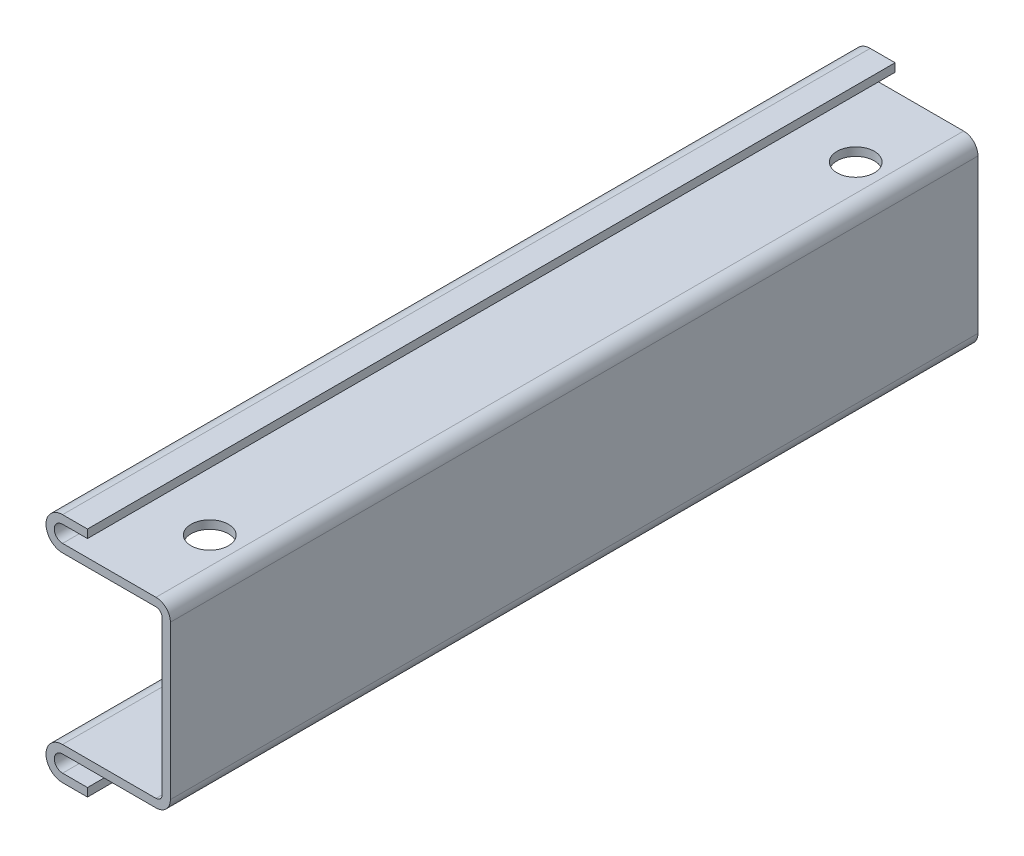
ISO-10303-21;
HEADER;
FILE_DESCRIPTION(('STEP AP214'),'2;1');
FILE_NAME('part.step','',(''),(''),'','','');
FILE_SCHEMA(('AUTOMOTIVE_DESIGN { 1 0 10303 214 1 1 1 1 }'));
ENDSEC;
DATA;
#1=APPLICATION_CONTEXT('core data for automotive mechanical design processes');
#2=APPLICATION_PROTOCOL_DEFINITION('international standard','automotive_design',2000,#1);
#3=PRODUCT_CONTEXT('',#1,'mechanical');
#4=PRODUCT('Part','Part','',(#3));
#5=PRODUCT_RELATED_PRODUCT_CATEGORY('part','',(#4));
#6=PRODUCT_DEFINITION_FORMATION('','',#4);
#7=PRODUCT_DEFINITION_CONTEXT('part definition',#1,'design');
#8=PRODUCT_DEFINITION('design','',#6,#7);
#9=PRODUCT_DEFINITION_SHAPE('','',#8);
#10=(LENGTH_UNIT() NAMED_UNIT(*) SI_UNIT(.MILLI.,.METRE.));
#11=(NAMED_UNIT(*) PLANE_ANGLE_UNIT() SI_UNIT($,.RADIAN.));
#12=(NAMED_UNIT(*) SI_UNIT($,.STERADIAN.) SOLID_ANGLE_UNIT());
#13=UNCERTAINTY_MEASURE_WITH_UNIT(LENGTH_MEASURE(1.E-05),#10,'distance_accuracy_value','');
#14=(GEOMETRIC_REPRESENTATION_CONTEXT(3) GLOBAL_UNCERTAINTY_ASSIGNED_CONTEXT((#13)) GLOBAL_UNIT_ASSIGNED_CONTEXT((#10,
#11,#12)) REPRESENTATION_CONTEXT('',''));
#15=CARTESIAN_POINT('',(0.,0.,0.));
#16=DIRECTION('',(0.,0.,1.));
#17=DIRECTION('',(1.,0.,0.));
#18=AXIS2_PLACEMENT_3D('',#15,#16,#17);
#19=CARTESIAN_POINT('',(-1.7365999999992,0.,97.4));
#20=DIRECTION('',(0.,0.,-1.));
#21=DIRECTION('',(-1.,0.,0.));
#22=AXIS2_PLACEMENT_3D('',#19,#20,#21);
#23=CYLINDRICAL_SURFACE('',#22,0.736599999999754);
#24=CARTESIAN_POINT('',(-1.7365999999992,0.,0.));
#25=DIRECTION('',(0.,0.,-1.));
#26=DIRECTION('',(1.,0.,0.));
#27=AXIS2_PLACEMENT_3D('',#24,#25,#26);
#28=CIRCLE('',#27,0.736599999999754);
#29=CARTESIAN_POINT('',(-1.7365999999992,0.736599999999754,0.));
#30=VERTEX_POINT('',#29);
#31=CARTESIAN_POINT('',(-0.999999999999446,0.,0.));
#32=VERTEX_POINT('',#31);
#33=EDGE_CURVE('E205',#30,#32,#28,.T.);
#34=ORIENTED_EDGE('',*,*,#33,.T.);
#35=DIRECTION('',(0.,0.,-1.));
#36=VECTOR('',#35,1.);
#37=CARTESIAN_POINT('',(-0.999999999999446,0.,97.4));
#38=LINE('',#37,#36);
#39=CARTESIAN_POINT('',(-0.999999999999446,0.,97.4));
#40=VERTEX_POINT('',#39);
#41=EDGE_CURVE('E11',#40,#32,#38,.T.);
#42=ORIENTED_EDGE('',*,*,#41,.F.);
#43=CARTESIAN_POINT('',(-1.7365999999992,0.,97.4));
#44=DIRECTION('',(0.,0.,-1.));
#45=DIRECTION('',(1.,0.,0.));
#46=AXIS2_PLACEMENT_3D('',#43,#44,#45);
#47=CIRCLE('',#46,0.736599999999754);
#48=CARTESIAN_POINT('',(-1.7365999999992,0.736599999999754,97.4));
#49=VERTEX_POINT('',#48);
#50=EDGE_CURVE('E244',#49,#40,#47,.T.);
#51=ORIENTED_EDGE('',*,*,#50,.F.);
#52=DIRECTION('',(0.,0.,-1.));
#53=VECTOR('',#52,1.);
#54=CARTESIAN_POINT('',(-1.7365999999992,0.736599999999754,97.4));
#55=LINE('',#54,#53);
#56=EDGE_CURVE('E201',#49,#30,#55,.T.);
#57=ORIENTED_EDGE('',*,*,#56,.T.);
#58=EDGE_LOOP('',(#34,#42,#51,#57));
#59=FACE_BOUND('',#58,.T.);
#60=ADVANCED_FACE('F35',(#59),#23,.F.);
#61=CARTESIAN_POINT('',(-0.999999999999446,0.,97.4));
#62=DIRECTION('',(1.,0.,0.));
#63=DIRECTION('',(0.,0.,-1.));
#64=AXIS2_PLACEMENT_3D('',#61,#62,#63);
#65=PLANE('',#64);
#66=DIRECTION('',(0.,-1.,0.));
#67=VECTOR('',#66,1.);
#68=CARTESIAN_POINT('',(-0.999999999999446,0.,0.));
#69=LINE('',#68,#67);
#70=CARTESIAN_POINT('',(-0.999999999999446,-18.5268000000001,0.));
#71=VERTEX_POINT('',#70);
#72=EDGE_CURVE('E208',#32,#71,#69,.T.);
#73=ORIENTED_EDGE('',*,*,#72,.T.);
#74=DIRECTION('',(0.,0.,-1.));
#75=VECTOR('',#74,1.);
#76=CARTESIAN_POINT('',(-0.999999999999446,-18.5268000000001,97.4));
#77=LINE('',#76,#75);
#78=CARTESIAN_POINT('',(-0.999999999999446,-18.5268000000001,97.4));
#79=VERTEX_POINT('',#78);
#80=EDGE_CURVE('E44',#79,#71,#77,.T.);
#81=ORIENTED_EDGE('',*,*,#80,.F.);
#82=DIRECTION('',(0.,-1.,0.));
#83=VECTOR('',#82,1.);
#84=CARTESIAN_POINT('',(-0.999999999999446,0.,97.4));
#85=LINE('',#84,#83);
#86=EDGE_CURVE('E132',#40,#79,#85,.T.);
#87=ORIENTED_EDGE('',*,*,#86,.F.);
#88=ORIENTED_EDGE('',*,*,#41,.T.);
#89=EDGE_LOOP('',(#73,#81,#87,#88));
#90=FACE_BOUND('',#89,.T.);
#91=ADVANCED_FACE('F372',(#90),#65,.F.);
#92=CARTESIAN_POINT('',(-1.7365999999992,-18.5268000000001,97.4));
#93=DIRECTION('',(0.,0.,-1.));
#94=DIRECTION('',(-1.,0.,0.));
#95=AXIS2_PLACEMENT_3D('',#92,#93,#94);
#96=CYLINDRICAL_SURFACE('',#95,0.736599999999754);
#97=CARTESIAN_POINT('',(-1.7365999999992,-18.5268000000001,0.));
#98=DIRECTION('',(0.,0.,-1.));
#99=DIRECTION('',(1.,0.,0.));
#100=AXIS2_PLACEMENT_3D('',#97,#98,#99);
#101=CIRCLE('',#100,0.736599999999754);
#102=CARTESIAN_POINT('',(-1.7365999999992,-19.2633999999998,0.));
#103=VERTEX_POINT('',#102);
#104=EDGE_CURVE('E211',#71,#103,#101,.T.);
#105=ORIENTED_EDGE('',*,*,#104,.T.);
#106=DIRECTION('',(0.,0.,-1.));
#107=VECTOR('',#106,1.);
#108=CARTESIAN_POINT('',(-1.7365999999992,-19.2633999999998,97.4));
#109=LINE('',#108,#107);
#110=CARTESIAN_POINT('',(-1.7365999999992,-19.2633999999998,97.4));
#111=VERTEX_POINT('',#110);
#112=EDGE_CURVE('E287',#111,#103,#109,.T.);
#113=ORIENTED_EDGE('',*,*,#112,.F.);
#114=CARTESIAN_POINT('',(-1.7365999999992,-18.5268000000001,97.4));
#115=DIRECTION('',(0.,0.,-1.));
#116=DIRECTION('',(1.,0.,0.));
#117=AXIS2_PLACEMENT_3D('',#114,#115,#116);
#118=CIRCLE('',#117,0.736599999999754);
#119=EDGE_CURVE('E313',#79,#111,#118,.T.);
#120=ORIENTED_EDGE('',*,*,#119,.F.);
#121=ORIENTED_EDGE('',*,*,#80,.T.);
#122=EDGE_LOOP('',(#105,#113,#120,#121));
#123=FACE_BOUND('',#122,.T.);
#124=ADVANCED_FACE('F376',(#123),#96,.F.);
#125=CARTESIAN_POINT('',(-1.7365999999992,-19.2633999999998,97.4));
#126=DIRECTION('',(0.,-1.,0.));
#127=DIRECTION('',(0.,0.,-1.));
#128=AXIS2_PLACEMENT_3D('',#125,#126,#127);
#129=PLANE('',#128);
#130=CARTESIAN_POINT('',(-4.99999999999999,-19.2633999999998,9.74999999999999));
#131=DIRECTION('',(0.,-1.,0.));
#132=DIRECTION('',(0.,0.,-1.));
#133=AXIS2_PLACEMENT_3D('',#130,#131,#132);
#134=CIRCLE('',#133,2.25);
#135=CARTESIAN_POINT('',(-4.99999999999999,-19.2633999999998,7.49999999999999));
#136=VERTEX_POINT('',#135);
#137=EDGE_CURVE('E300',#136,#136,#134,.T.);
#138=ORIENTED_EDGE('',*,*,#137,.T.);
#139=EDGE_LOOP('',(#138));
#140=FACE_BOUND('',#139,.T.);
#141=CARTESIAN_POINT('',(-5.,-19.2633999999998,87.65));
#142=DIRECTION('',(0.,-1.,0.));
#143=DIRECTION('',(0.,0.,-1.));
#144=AXIS2_PLACEMENT_3D('',#141,#142,#143);
#145=CIRCLE('',#144,2.25);
#146=CARTESIAN_POINT('',(-5.,-19.2633999999998,85.4));
#147=VERTEX_POINT('',#146);
#148=EDGE_CURVE('E209',#147,#147,#145,.T.);
#149=ORIENTED_EDGE('',*,*,#148,.T.);
#150=EDGE_LOOP('',(#149));
#151=FACE_BOUND('',#150,.T.);
#152=DIRECTION('',(-1.,0.,0.));
#153=VECTOR('',#152,1.);
#154=CARTESIAN_POINT('',(-1.7365999999992,-19.2633999999998,0.));
#155=LINE('',#154,#153);
#156=CARTESIAN_POINT('',(-12.9999999999999,-19.2633999999998,0.));
#157=VERTEX_POINT('',#156);
#158=EDGE_CURVE('E213',#103,#157,#155,.T.);
#159=ORIENTED_EDGE('',*,*,#158,.T.);
#160=DIRECTION('',(0.,0.,-1.));
#161=VECTOR('',#160,1.);
#162=CARTESIAN_POINT('',(-12.9999999999999,-19.2633999999998,97.4));
#163=LINE('',#162,#161);
#164=CARTESIAN_POINT('',(-12.9999999999999,-19.2633999999998,97.4));
#165=VERTEX_POINT('',#164);
#166=EDGE_CURVE('E284',#165,#157,#163,.T.);
#167=ORIENTED_EDGE('',*,*,#166,.F.);
#168=DIRECTION('',(-1.,0.,0.));
#169=VECTOR('',#168,1.);
#170=CARTESIAN_POINT('',(-1.7365999999992,-19.2633999999998,97.4));
#171=LINE('',#170,#169);
#172=EDGE_CURVE('E315',#111,#165,#171,.T.);
#173=ORIENTED_EDGE('',*,*,#172,.F.);
#174=ORIENTED_EDGE('',*,*,#112,.T.);
#175=EDGE_LOOP('',(#159,#167,#173,#174));
#176=FACE_BOUND('',#175,.T.);
#177=ADVANCED_FACE('F380',(#140,#151,#176),#129,.F.);
#178=CARTESIAN_POINT('',(-12.9999999999999,-21.2633999999996,97.4));
#179=DIRECTION('',(0.,0.,-1.));
#180=DIRECTION('',(-1.,0.,0.));
#181=AXIS2_PLACEMENT_3D('',#178,#179,#180);
#182=CYLINDRICAL_SURFACE('',#181,1.99999999999978);
#183=CARTESIAN_POINT('',(-12.9999999999999,-21.2633999999996,0.));
#184=DIRECTION('',(0.,0.,1.));
#185=DIRECTION('',(1.,0.,0.));
#186=AXIS2_PLACEMENT_3D('',#183,#184,#185);
#187=CIRCLE('',#186,1.99999999999978);
#188=CARTESIAN_POINT('',(-12.9999999999999,-23.2633999999994,0.));
#189=VERTEX_POINT('',#188);
#190=EDGE_CURVE('E215',#157,#189,#187,.T.);
#191=ORIENTED_EDGE('',*,*,#190,.T.);
#192=DIRECTION('',(0.,0.,-1.));
#193=VECTOR('',#192,1.);
#194=CARTESIAN_POINT('',(-12.9999999999999,-23.2633999999994,97.4));
#195=LINE('',#194,#193);
#196=CARTESIAN_POINT('',(-12.9999999999999,-23.2633999999994,97.4));
#197=VERTEX_POINT('',#196);
#198=EDGE_CURVE('E281',#197,#189,#195,.T.);
#199=ORIENTED_EDGE('',*,*,#198,.F.);
#200=CARTESIAN_POINT('',(-12.9999999999999,-21.2633999999996,97.4));
#201=DIRECTION('',(0.,0.,1.));
#202=DIRECTION('',(1.,0.,0.));
#203=AXIS2_PLACEMENT_3D('',#200,#201,#202);
#204=CIRCLE('',#203,1.99999999999978);
#205=EDGE_CURVE('E317',#165,#197,#204,.T.);
#206=ORIENTED_EDGE('',*,*,#205,.F.);
#207=ORIENTED_EDGE('',*,*,#166,.T.);
#208=EDGE_LOOP('',(#191,#199,#206,#207));
#209=FACE_BOUND('',#208,.T.);
#210=ADVANCED_FACE('F386',(#209),#182,.T.);
#211=CARTESIAN_POINT('',(-12.9999999999999,-23.2633999999994,97.4));
#212=DIRECTION('',(0.,1.,0.));
#213=DIRECTION('',(0.,0.,1.));
#214=AXIS2_PLACEMENT_3D('',#211,#212,#213);
#215=PLANE('',#214);
#216=DIRECTION('',(1.,0.,0.));
#217=VECTOR('',#216,1.);
#218=CARTESIAN_POINT('',(-12.9999999999999,-23.2633999999994,0.));
#219=LINE('',#218,#217);
#220=CARTESIAN_POINT('',(-9.99999999999979,-23.2633999999994,0.));
#221=VERTEX_POINT('',#220);
#222=EDGE_CURVE('E217',#189,#221,#219,.T.);
#223=ORIENTED_EDGE('',*,*,#222,.T.);
#224=DIRECTION('',(0.,0.,-1.));
#225=VECTOR('',#224,1.);
#226=CARTESIAN_POINT('',(-9.99999999999979,-23.2633999999994,97.4));
#227=LINE('',#226,#225);
#228=CARTESIAN_POINT('',(-9.99999999999979,-23.2633999999994,97.4));
#229=VERTEX_POINT('',#228);
#230=EDGE_CURVE('E278',#229,#221,#227,.T.);
#231=ORIENTED_EDGE('',*,*,#230,.F.);
#232=DIRECTION('',(1.,0.,0.));
#233=VECTOR('',#232,1.);
#234=CARTESIAN_POINT('',(-12.9999999999999,-23.2633999999994,97.4));
#235=LINE('',#234,#233);
#236=EDGE_CURVE('E319',#197,#229,#235,.T.);
#237=ORIENTED_EDGE('',*,*,#236,.F.);
#238=ORIENTED_EDGE('',*,*,#198,.T.);
#239=EDGE_LOOP('',(#223,#231,#237,#238));
#240=FACE_BOUND('',#239,.T.);
#241=ADVANCED_FACE('F390',(#240),#215,.F.);
#242=CARTESIAN_POINT('',(-9.99999999999979,-22.2633999999999,97.4));
#243=DIRECTION('',(-1.,0.,0.));
#244=DIRECTION('',(0.,0.,1.));
#245=AXIS2_PLACEMENT_3D('',#242,#243,#244);
#246=PLANE('',#245);
#247=DIRECTION('',(0.,1.,0.));
#248=VECTOR('',#247,1.);
#249=CARTESIAN_POINT('',(-9.99999999999979,-22.2633999999999,0.));
#250=LINE('',#249,#248);
#251=CARTESIAN_POINT('',(-9.99999999999979,-22.2633999999999,0.));
#252=VERTEX_POINT('',#251);
#253=EDGE_CURVE('E219',#221,#252,#250,.T.);
#254=ORIENTED_EDGE('',*,*,#253,.T.);
#255=DIRECTION('',(0.,0.,-1.));
#256=VECTOR('',#255,1.);
#257=CARTESIAN_POINT('',(-9.99999999999979,-22.2633999999999,97.4));
#258=LINE('',#257,#256);
#259=CARTESIAN_POINT('',(-9.99999999999979,-22.2633999999999,97.4));
#260=VERTEX_POINT('',#259);
#261=EDGE_CURVE('E275',#260,#252,#258,.T.);
#262=ORIENTED_EDGE('',*,*,#261,.F.);
#263=DIRECTION('',(0.,1.,0.));
#264=VECTOR('',#263,1.);
#265=CARTESIAN_POINT('',(-9.99999999999979,-22.2633999999999,97.4));
#266=LINE('',#265,#264);
#267=EDGE_CURVE('E321',#229,#260,#266,.T.);
#268=ORIENTED_EDGE('',*,*,#267,.F.);
#269=ORIENTED_EDGE('',*,*,#230,.T.);
#270=EDGE_LOOP('',(#254,#262,#268,#269));
#271=FACE_BOUND('',#270,.T.);
#272=ADVANCED_FACE('F394',(#271),#246,.F.);
#273=CARTESIAN_POINT('',(-12.9999999999999,-22.2633999999999,97.4));
#274=DIRECTION('',(0.,-1.,0.));
#275=DIRECTION('',(0.,0.,-1.));
#276=AXIS2_PLACEMENT_3D('',#273,#274,#275);
#277=PLANE('',#276);
#278=DIRECTION('',(-1.,0.,0.));
#279=VECTOR('',#278,1.);
#280=CARTESIAN_POINT('',(-12.9999999999999,-22.2633999999999,0.));
#281=LINE('',#280,#279);
#282=CARTESIAN_POINT('',(-12.9999999999999,-22.2633999999999,0.));
#283=VERTEX_POINT('',#282);
#284=EDGE_CURVE('E221',#252,#283,#281,.T.);
#285=ORIENTED_EDGE('',*,*,#284,.T.);
#286=DIRECTION('',(0.,0.,-1.));
#287=VECTOR('',#286,1.);
#288=CARTESIAN_POINT('',(-12.9999999999999,-22.2633999999999,97.4));
#289=LINE('',#288,#287);
#290=CARTESIAN_POINT('',(-12.9999999999999,-22.2633999999999,97.4));
#291=VERTEX_POINT('',#290);
#292=EDGE_CURVE('E272',#291,#283,#289,.T.);
#293=ORIENTED_EDGE('',*,*,#292,.F.);
#294=DIRECTION('',(-1.,0.,0.));
#295=VECTOR('',#294,1.);
#296=CARTESIAN_POINT('',(-12.9999999999999,-22.2633999999999,97.4));
#297=LINE('',#296,#295);
#298=EDGE_CURVE('E323',#260,#291,#297,.T.);
#299=ORIENTED_EDGE('',*,*,#298,.F.);
#300=ORIENTED_EDGE('',*,*,#261,.T.);
#301=EDGE_LOOP('',(#285,#293,#299,#300));
#302=FACE_BOUND('',#301,.T.);
#303=ADVANCED_FACE('F398',(#302),#277,.F.);
#304=CARTESIAN_POINT('',(-12.9999999999999,-21.2633999999996,97.4));
#305=DIRECTION('',(0.,0.,-1.));
#306=DIRECTION('',(-1.,0.,0.));
#307=AXIS2_PLACEMENT_3D('',#304,#305,#306);
#308=CYLINDRICAL_SURFACE('',#307,1.00000000000033);
#309=CARTESIAN_POINT('',(-12.9999999999999,-21.2633999999996,0.));
#310=DIRECTION('',(0.,0.,-1.));
#311=DIRECTION('',(1.,0.,0.));
#312=AXIS2_PLACEMENT_3D('',#309,#310,#311);
#313=CIRCLE('',#312,1.00000000000033);
#314=CARTESIAN_POINT('',(-12.9999999999999,-20.2633999999993,0.));
#315=VERTEX_POINT('',#314);
#316=EDGE_CURVE('E223',#283,#315,#313,.T.);
#317=ORIENTED_EDGE('',*,*,#316,.T.);
#318=DIRECTION('',(0.,0.,-1.));
#319=VECTOR('',#318,1.);
#320=CARTESIAN_POINT('',(-12.9999999999999,-20.2633999999993,97.4));
#321=LINE('',#320,#319);
#322=CARTESIAN_POINT('',(-12.9999999999999,-20.2633999999993,97.4));
#323=VERTEX_POINT('',#322);
#324=EDGE_CURVE('E269',#323,#315,#321,.T.);
#325=ORIENTED_EDGE('',*,*,#324,.F.);
#326=CARTESIAN_POINT('',(-12.9999999999999,-21.2633999999996,97.4));
#327=DIRECTION('',(0.,0.,-1.));
#328=DIRECTION('',(1.,0.,0.));
#329=AXIS2_PLACEMENT_3D('',#326,#327,#328);
#330=CIRCLE('',#329,1.00000000000033);
#331=EDGE_CURVE('E325',#291,#323,#330,.T.);
#332=ORIENTED_EDGE('',*,*,#331,.F.);
#333=ORIENTED_EDGE('',*,*,#292,.T.);
#334=EDGE_LOOP('',(#317,#325,#332,#333));
#335=FACE_BOUND('',#334,.T.);
#336=ADVANCED_FACE('F402',(#335),#308,.F.);
#337=CARTESIAN_POINT('',(-1.7365999999992,-20.2633999999993,97.4));
#338=DIRECTION('',(0.,1.,0.));
#339=DIRECTION('',(0.,0.,1.));
#340=AXIS2_PLACEMENT_3D('',#337,#338,#339);
#341=PLANE('',#340);
#342=CARTESIAN_POINT('',(-4.99999999999999,-20.2633999999993,9.74999999999999));
#343=DIRECTION('',(0.,-1.,0.));
#344=DIRECTION('',(0.,0.,1.));
#345=AXIS2_PLACEMENT_3D('',#342,#343,#344);
#346=CIRCLE('',#345,2.25);
#347=CARTESIAN_POINT('',(-4.99999999999999,-20.2633999999993,12.));
#348=VERTEX_POINT('',#347);
#349=EDGE_CURVE('E501',#348,#348,#346,.T.);
#350=ORIENTED_EDGE('',*,*,#349,.F.);
#351=EDGE_LOOP('',(#350));
#352=FACE_BOUND('',#351,.T.);
#353=CARTESIAN_POINT('',(-5.,-20.2633999999993,87.65));
#354=DIRECTION('',(0.,-1.,0.));
#355=DIRECTION('',(0.,0.,-1.));
#356=AXIS2_PLACEMENT_3D('',#353,#354,#355);
#357=CIRCLE('',#356,2.25);
#358=CARTESIAN_POINT('',(-5.,-20.2633999999993,85.4));
#359=VERTEX_POINT('',#358);
#360=EDGE_CURVE('E294',#359,#359,#357,.T.);
#361=ORIENTED_EDGE('',*,*,#360,.F.);
#362=EDGE_LOOP('',(#361));
#363=FACE_BOUND('',#362,.T.);
#364=DIRECTION('',(1.,0.,0.));
#365=VECTOR('',#364,1.);
#366=CARTESIAN_POINT('',(-1.7365999999992,-20.2633999999993,0.));
#367=LINE('',#366,#365);
#368=CARTESIAN_POINT('',(-1.7365999999992,-20.2633999999993,0.));
#369=VERTEX_POINT('',#368);
#370=EDGE_CURVE('E225',#315,#369,#367,.T.);
#371=ORIENTED_EDGE('',*,*,#370,.T.);
#372=DIRECTION('',(0.,0.,-1.));
#373=VECTOR('',#372,1.);
#374=CARTESIAN_POINT('',(-1.7365999999992,-20.2633999999993,97.4));
#375=LINE('',#374,#373);
#376=CARTESIAN_POINT('',(-1.7365999999992,-20.2633999999993,97.4));
#377=VERTEX_POINT('',#376);
#378=EDGE_CURVE('E266',#377,#369,#375,.T.);
#379=ORIENTED_EDGE('',*,*,#378,.F.);
#380=DIRECTION('',(1.,0.,0.));
#381=VECTOR('',#380,1.);
#382=CARTESIAN_POINT('',(-1.7365999999992,-20.2633999999993,97.4));
#383=LINE('',#382,#381);
#384=EDGE_CURVE('E327',#323,#377,#383,.T.);
#385=ORIENTED_EDGE('',*,*,#384,.F.);
#386=ORIENTED_EDGE('',*,*,#324,.T.);
#387=EDGE_LOOP('',(#371,#379,#385,#386));
#388=FACE_BOUND('',#387,.T.);
#389=ADVANCED_FACE('F406',(#352,#363,#388),#341,.F.);
#390=CARTESIAN_POINT('',(-1.7365999999992,-18.5268000000001,97.4));
#391=DIRECTION('',(0.,0.,-1.));
#392=DIRECTION('',(-1.,0.,0.));
#393=AXIS2_PLACEMENT_3D('',#390,#391,#392);
#394=CYLINDRICAL_SURFACE('',#393,1.7365999999992);
#395=CARTESIAN_POINT('',(-1.7365999999992,-18.5268000000001,0.));
#396=DIRECTION('',(0.,0.,1.));
#397=DIRECTION('',(1.,0.,0.));
#398=AXIS2_PLACEMENT_3D('',#395,#396,#397);
#399=CIRCLE('',#398,1.7365999999992);
#400=CARTESIAN_POINT('',(0.,-18.5268000000001,0.));
#401=VERTEX_POINT('',#400);
#402=EDGE_CURVE('E227',#369,#401,#399,.T.);
#403=ORIENTED_EDGE('',*,*,#402,.T.);
#404=DIRECTION('',(0.,0.,-1.));
#405=VECTOR('',#404,1.);
#406=CARTESIAN_POINT('',(0.,-18.5268000000001,97.4));
#407=LINE('',#406,#405);
#408=CARTESIAN_POINT('',(0.,-18.5268000000001,97.4));
#409=VERTEX_POINT('',#408);
#410=EDGE_CURVE('E263',#409,#401,#407,.T.);
#411=ORIENTED_EDGE('',*,*,#410,.F.);
#412=CARTESIAN_POINT('',(-1.7365999999992,-18.5268000000001,97.4));
#413=DIRECTION('',(0.,0.,1.));
#414=DIRECTION('',(1.,0.,0.));
#415=AXIS2_PLACEMENT_3D('',#412,#413,#414);
#416=CIRCLE('',#415,1.7365999999992);
#417=EDGE_CURVE('E329',#377,#409,#416,.T.);
#418=ORIENTED_EDGE('',*,*,#417,.F.);
#419=ORIENTED_EDGE('',*,*,#378,.T.);
#420=EDGE_LOOP('',(#403,#411,#418,#419));
#421=FACE_BOUND('',#420,.T.);
#422=ADVANCED_FACE('F410',(#421),#394,.T.);
#423=CARTESIAN_POINT('',(0.,0.,97.4));
#424=DIRECTION('',(-1.,0.,0.));
#425=DIRECTION('',(0.,0.,1.));
#426=AXIS2_PLACEMENT_3D('',#423,#424,#425);
#427=PLANE('',#426);
#428=DIRECTION('',(0.,1.,0.));
#429=VECTOR('',#428,1.);
#430=CARTESIAN_POINT('',(0.,0.,0.));
#431=LINE('',#430,#429);
#432=CARTESIAN_POINT('',(0.,0.,0.));
#433=VERTEX_POINT('',#432);
#434=EDGE_CURVE('E229',#401,#433,#431,.T.);
#435=ORIENTED_EDGE('',*,*,#434,.T.);
#436=DIRECTION('',(0.,0.,-1.));
#437=VECTOR('',#436,1.);
#438=CARTESIAN_POINT('',(0.,0.,97.4));
#439=LINE('',#438,#437);
#440=CARTESIAN_POINT('',(0.,0.,97.4));
#441=VERTEX_POINT('',#440);
#442=EDGE_CURVE('E260',#441,#433,#439,.T.);
#443=ORIENTED_EDGE('',*,*,#442,.F.);
#444=DIRECTION('',(0.,1.,0.));
#445=VECTOR('',#444,1.);
#446=CARTESIAN_POINT('',(0.,0.,97.4));
#447=LINE('',#446,#445);
#448=EDGE_CURVE('E331',#409,#441,#447,.T.);
#449=ORIENTED_EDGE('',*,*,#448,.F.);
#450=ORIENTED_EDGE('',*,*,#410,.T.);
#451=EDGE_LOOP('',(#435,#443,#449,#450));
#452=FACE_BOUND('',#451,.T.);
#453=ADVANCED_FACE('F414',(#452),#427,.F.);
#454=CARTESIAN_POINT('',(-1.7365999999992,0.,97.4));
#455=DIRECTION('',(0.,0.,-1.));
#456=DIRECTION('',(-1.,0.,0.));
#457=AXIS2_PLACEMENT_3D('',#454,#455,#456);
#458=CYLINDRICAL_SURFACE('',#457,1.7365999999992);
#459=CARTESIAN_POINT('',(-1.7365999999992,0.,0.));
#460=DIRECTION('',(0.,0.,1.));
#461=DIRECTION('',(1.,0.,0.));
#462=AXIS2_PLACEMENT_3D('',#459,#460,#461);
#463=CIRCLE('',#462,1.7365999999992);
#464=CARTESIAN_POINT('',(-1.7365999999992,1.7365999999992,0.));
#465=VERTEX_POINT('',#464);
#466=EDGE_CURVE('E231',#433,#465,#463,.T.);
#467=ORIENTED_EDGE('',*,*,#466,.T.);
#468=DIRECTION('',(0.,0.,-1.));
#469=VECTOR('',#468,1.);
#470=CARTESIAN_POINT('',(-1.7365999999992,1.7365999999992,97.4));
#471=LINE('',#470,#469);
#472=CARTESIAN_POINT('',(-1.7365999999992,1.7365999999992,97.4));
#473=VERTEX_POINT('',#472);
#474=EDGE_CURVE('E257',#473,#465,#471,.T.);
#475=ORIENTED_EDGE('',*,*,#474,.F.);
#476=CARTESIAN_POINT('',(-1.7365999999992,0.,97.4));
#477=DIRECTION('',(0.,0.,1.));
#478=DIRECTION('',(1.,0.,0.));
#479=AXIS2_PLACEMENT_3D('',#476,#477,#478);
#480=CIRCLE('',#479,1.7365999999992);
#481=EDGE_CURVE('E333',#441,#473,#480,.T.);
#482=ORIENTED_EDGE('',*,*,#481,.F.);
#483=ORIENTED_EDGE('',*,*,#442,.T.);
#484=EDGE_LOOP('',(#467,#475,#482,#483));
#485=FACE_BOUND('',#484,.T.);
#486=ADVANCED_FACE('F418',(#485),#458,.T.);
#487=CARTESIAN_POINT('',(-12.9999999999999,1.7365999999992,97.4));
#488=DIRECTION('',(0.,-1.,0.));
#489=DIRECTION('',(0.,0.,-1.));
#490=AXIS2_PLACEMENT_3D('',#487,#488,#489);
#491=PLANE('',#490);
#492=CARTESIAN_POINT('',(-4.99999999999999,1.7365999999992,9.74999999999999));
#493=DIRECTION('',(0.,-1.,0.));
#494=DIRECTION('',(0.,0.,-1.));
#495=AXIS2_PLACEMENT_3D('',#492,#493,#494);
#496=CIRCLE('',#495,2.25);
#497=CARTESIAN_POINT('',(-4.99999999999999,1.7365999999992,7.49999999999999));
#498=VERTEX_POINT('',#497);
#499=EDGE_CURVE('E305',#498,#498,#496,.T.);
#500=ORIENTED_EDGE('',*,*,#499,.T.);
#501=EDGE_LOOP('',(#500));
#502=FACE_BOUND('',#501,.T.);
#503=CARTESIAN_POINT('',(-5.,1.7365999999992,87.65));
#504=DIRECTION('',(0.,-1.,0.));
#505=DIRECTION('',(0.,0.,-1.));
#506=AXIS2_PLACEMENT_3D('',#503,#504,#505);
#507=CIRCLE('',#506,2.25);
#508=CARTESIAN_POINT('',(-5.,1.7365999999992,85.4));
#509=VERTEX_POINT('',#508);
#510=EDGE_CURVE('E293',#509,#509,#507,.T.);
#511=ORIENTED_EDGE('',*,*,#510,.T.);
#512=EDGE_LOOP('',(#511));
#513=FACE_BOUND('',#512,.T.);
#514=DIRECTION('',(-1.,0.,0.));
#515=VECTOR('',#514,1.);
#516=CARTESIAN_POINT('',(-12.9999999999999,1.7365999999992,0.));
#517=LINE('',#516,#515);
#518=CARTESIAN_POINT('',(-12.9999999999999,1.7365999999992,0.));
#519=VERTEX_POINT('',#518);
#520=EDGE_CURVE('E233',#465,#519,#517,.T.);
#521=ORIENTED_EDGE('',*,*,#520,.T.);
#522=DIRECTION('',(0.,0.,-1.));
#523=VECTOR('',#522,1.);
#524=CARTESIAN_POINT('',(-12.9999999999999,1.7365999999992,97.4));
#525=LINE('',#524,#523);
#526=CARTESIAN_POINT('',(-12.9999999999999,1.7365999999992,97.4));
#527=VERTEX_POINT('',#526);
#528=EDGE_CURVE('E254',#527,#519,#525,.T.);
#529=ORIENTED_EDGE('',*,*,#528,.F.);
#530=DIRECTION('',(-1.,0.,0.));
#531=VECTOR('',#530,1.);
#532=CARTESIAN_POINT('',(-12.9999999999999,1.7365999999992,97.4));
#533=LINE('',#532,#531);
#534=EDGE_CURVE('E335',#473,#527,#533,.T.);
#535=ORIENTED_EDGE('',*,*,#534,.F.);
#536=ORIENTED_EDGE('',*,*,#474,.T.);
#537=EDGE_LOOP('',(#521,#529,#535,#536));
#538=FACE_BOUND('',#537,.T.);
#539=ADVANCED_FACE('F422',(#502,#513,#538),#491,.F.);
#540=CARTESIAN_POINT('',(-12.9999999999999,2.73659999999909,97.4));
#541=DIRECTION('',(0.,0.,-1.));
#542=DIRECTION('',(-1.,0.,0.));
#543=AXIS2_PLACEMENT_3D('',#540,#541,#542);
#544=CYLINDRICAL_SURFACE('',#543,0.99999999999989);
#545=CARTESIAN_POINT('',(-12.9999999999999,2.73659999999909,0.));
#546=DIRECTION('',(0.,0.,-1.));
#547=DIRECTION('',(1.,0.,0.));
#548=AXIS2_PLACEMENT_3D('',#545,#546,#547);
#549=CIRCLE('',#548,0.99999999999989);
#550=CARTESIAN_POINT('',(-12.9999999999999,3.73659999999898,0.));
#551=VERTEX_POINT('',#550);
#552=EDGE_CURVE('E235',#519,#551,#549,.T.);
#553=ORIENTED_EDGE('',*,*,#552,.T.);
#554=DIRECTION('',(0.,0.,-1.));
#555=VECTOR('',#554,1.);
#556=CARTESIAN_POINT('',(-12.9999999999999,3.73659999999898,97.4));
#557=LINE('',#556,#555);
#558=CARTESIAN_POINT('',(-12.9999999999999,3.73659999999898,97.4));
#559=VERTEX_POINT('',#558);
#560=EDGE_CURVE('E251',#559,#551,#557,.T.);
#561=ORIENTED_EDGE('',*,*,#560,.F.);
#562=CARTESIAN_POINT('',(-12.9999999999999,2.73659999999909,97.4));
#563=DIRECTION('',(0.,0.,-1.));
#564=DIRECTION('',(1.,0.,0.));
#565=AXIS2_PLACEMENT_3D('',#562,#563,#564);
#566=CIRCLE('',#565,0.99999999999989);
#567=EDGE_CURVE('E337',#527,#559,#566,.T.);
#568=ORIENTED_EDGE('',*,*,#567,.F.);
#569=ORIENTED_EDGE('',*,*,#528,.T.);
#570=EDGE_LOOP('',(#553,#561,#568,#569));
#571=FACE_BOUND('',#570,.T.);
#572=ADVANCED_FACE('F425',(#571),#544,.F.);
#573=CARTESIAN_POINT('',(-9.99999999999979,3.73659999999898,97.4));
#574=DIRECTION('',(0.,1.,0.));
#575=DIRECTION('',(0.,0.,1.));
#576=AXIS2_PLACEMENT_3D('',#573,#574,#575);
#577=PLANE('',#576);
#578=DIRECTION('',(1.,0.,0.));
#579=VECTOR('',#578,1.);
#580=CARTESIAN_POINT('',(-9.99999999999979,3.73659999999898,0.));
#581=LINE('',#580,#579);
#582=CARTESIAN_POINT('',(-9.99999999999979,3.73659999999898,0.));
#583=VERTEX_POINT('',#582);
#584=EDGE_CURVE('E237',#551,#583,#581,.T.);
#585=ORIENTED_EDGE('',*,*,#584,.T.);
#586=DIRECTION('',(0.,0.,-1.));
#587=VECTOR('',#586,1.);
#588=CARTESIAN_POINT('',(-9.99999999999979,3.73659999999898,97.4));
#589=LINE('',#588,#587);
#590=CARTESIAN_POINT('',(-9.99999999999979,3.73659999999898,97.4));
#591=VERTEX_POINT('',#590);
#592=EDGE_CURVE('E248',#591,#583,#589,.T.);
#593=ORIENTED_EDGE('',*,*,#592,.F.);
#594=DIRECTION('',(1.,0.,0.));
#595=VECTOR('',#594,1.);
#596=CARTESIAN_POINT('',(-9.99999999999979,3.73659999999898,97.4));
#597=LINE('',#596,#595);
#598=EDGE_CURVE('E339',#559,#591,#597,.T.);
#599=ORIENTED_EDGE('',*,*,#598,.F.);
#600=ORIENTED_EDGE('',*,*,#560,.T.);
#601=EDGE_LOOP('',(#585,#593,#599,#600));
#602=FACE_BOUND('',#601,.T.);
#603=ADVANCED_FACE('F345',(#602),#577,.F.);
#604=CARTESIAN_POINT('',(-9.99999999999979,3.73659999999898,97.4));
#605=DIRECTION('',(-1.,0.,0.));
#606=DIRECTION('',(0.,0.,1.));
#607=AXIS2_PLACEMENT_3D('',#604,#605,#606);
#608=PLANE('',#607);
#609=DIRECTION('',(0.,1.,0.));
#610=VECTOR('',#609,1.);
#611=CARTESIAN_POINT('',(-9.99999999999979,3.73659999999898,0.));
#612=LINE('',#611,#610);
#613=CARTESIAN_POINT('',(-9.99999999999979,4.73659999999843,0.));
#614=VERTEX_POINT('',#613);
#615=EDGE_CURVE('E239',#583,#614,#612,.T.);
#616=ORIENTED_EDGE('',*,*,#615,.T.);
#617=DIRECTION('',(0.,0.,-1.));
#618=VECTOR('',#617,1.);
#619=CARTESIAN_POINT('',(-9.99999999999979,4.73659999999843,97.4));
#620=LINE('',#619,#618);
#621=CARTESIAN_POINT('',(-9.99999999999979,4.73659999999843,97.4));
#622=VERTEX_POINT('',#621);
#623=EDGE_CURVE('E196',#622,#614,#620,.T.);
#624=ORIENTED_EDGE('',*,*,#623,.F.);
#625=DIRECTION('',(0.,1.,0.));
#626=VECTOR('',#625,1.);
#627=CARTESIAN_POINT('',(-9.99999999999979,3.73659999999898,97.4));
#628=LINE('',#627,#626);
#629=EDGE_CURVE('E187',#591,#622,#628,.T.);
#630=ORIENTED_EDGE('',*,*,#629,.F.);
#631=ORIENTED_EDGE('',*,*,#592,.T.);
#632=EDGE_LOOP('',(#616,#624,#630,#631));
#633=FACE_BOUND('',#632,.T.);
#634=ADVANCED_FACE('F349',(#633),#608,.F.);
#635=CARTESIAN_POINT('',(-9.99999999999979,4.73659999999843,97.4));
#636=DIRECTION('',(0.,-1.,0.));
#637=DIRECTION('',(0.,0.,-1.));
#638=AXIS2_PLACEMENT_3D('',#635,#636,#637);
#639=PLANE('',#638);
#640=DIRECTION('',(-1.,0.,0.));
#641=VECTOR('',#640,1.);
#642=CARTESIAN_POINT('',(-9.99999999999979,4.73659999999843,0.));
#643=LINE('',#642,#641);
#644=CARTESIAN_POINT('',(-12.9999999999999,4.73659999999843,0.));
#645=VERTEX_POINT('',#644);
#646=EDGE_CURVE('E195',#614,#645,#643,.T.);
#647=ORIENTED_EDGE('',*,*,#646,.T.);
#648=DIRECTION('',(0.,0.,-1.));
#649=VECTOR('',#648,1.);
#650=CARTESIAN_POINT('',(-12.9999999999999,4.73659999999843,97.4));
#651=LINE('',#650,#649);
#652=CARTESIAN_POINT('',(-12.9999999999999,4.73659999999843,97.4));
#653=VERTEX_POINT('',#652);
#654=EDGE_CURVE('E192',#653,#645,#651,.T.);
#655=ORIENTED_EDGE('',*,*,#654,.F.);
#656=DIRECTION('',(-1.,0.,0.));
#657=VECTOR('',#656,1.);
#658=CARTESIAN_POINT('',(-9.99999999999979,4.73659999999843,97.4));
#659=LINE('',#658,#657);
#660=EDGE_CURVE('E181',#622,#653,#659,.T.);
#661=ORIENTED_EDGE('',*,*,#660,.F.);
#662=ORIENTED_EDGE('',*,*,#623,.T.);
#663=EDGE_LOOP('',(#647,#655,#661,#662));
#664=FACE_BOUND('',#663,.T.);
#665=ADVANCED_FACE('F193',(#664),#639,.F.);
#666=CARTESIAN_POINT('',(-12.9999999999999,2.73659999999909,97.4));
#667=DIRECTION('',(0.,0.,-1.));
#668=DIRECTION('',(-1.,0.,0.));
#669=AXIS2_PLACEMENT_3D('',#666,#667,#668);
#670=CYLINDRICAL_SURFACE('',#669,1.99999999999934);
#671=CARTESIAN_POINT('',(-12.9999999999999,2.73659999999909,0.));
#672=DIRECTION('',(0.,0.,1.));
#673=DIRECTION('',(1.,0.,0.));
#674=AXIS2_PLACEMENT_3D('',#671,#672,#673);
#675=CIRCLE('',#674,1.99999999999934);
#676=CARTESIAN_POINT('',(-12.9999999999999,0.736599999999754,0.));
#677=VERTEX_POINT('',#676);
#678=EDGE_CURVE('E118',#645,#677,#675,.T.);
#679=ORIENTED_EDGE('',*,*,#678,.T.);
#680=DIRECTION('',(0.,0.,-1.));
#681=VECTOR('',#680,1.);
#682=CARTESIAN_POINT('',(-12.9999999999999,0.736599999999754,97.4));
#683=LINE('',#682,#681);
#684=CARTESIAN_POINT('',(-12.9999999999999,0.736599999999754,97.4));
#685=VERTEX_POINT('',#684);
#686=EDGE_CURVE('E197',#685,#677,#683,.T.);
#687=ORIENTED_EDGE('',*,*,#686,.F.);
#688=CARTESIAN_POINT('',(-12.9999999999999,2.73659999999909,97.4));
#689=DIRECTION('',(0.,0.,1.));
#690=DIRECTION('',(1.,0.,0.));
#691=AXIS2_PLACEMENT_3D('',#688,#689,#690);
#692=CIRCLE('',#691,1.99999999999934);
#693=EDGE_CURVE('E185',#653,#685,#692,.T.);
#694=ORIENTED_EDGE('',*,*,#693,.F.);
#695=ORIENTED_EDGE('',*,*,#654,.T.);
#696=EDGE_LOOP('',(#679,#687,#694,#695));
#697=FACE_BOUND('',#696,.T.);
#698=ADVANCED_FACE('F199',(#697),#670,.T.);
#699=CARTESIAN_POINT('',(-12.9999999999999,0.736599999999754,97.4));
#700=DIRECTION('',(0.,1.,0.));
#701=DIRECTION('',(0.,0.,1.));
#702=AXIS2_PLACEMENT_3D('',#699,#700,#701);
#703=PLANE('',#702);
#704=CARTESIAN_POINT('',(-4.99999999999999,0.736599999999754,9.74999999999999));
#705=DIRECTION('',(0.,1.,0.));
#706=DIRECTION('',(0.,0.,1.));
#707=AXIS2_PLACEMENT_3D('',#704,#705,#706);
#708=CIRCLE('',#707,2.25);
#709=CARTESIAN_POINT('',(-4.99999999999999,0.736599999999754,12.));
#710=VERTEX_POINT('',#709);
#711=EDGE_CURVE('E38',#710,#710,#708,.T.);
#712=ORIENTED_EDGE('',*,*,#711,.T.);
#713=EDGE_LOOP('',(#712));
#714=FACE_BOUND('',#713,.T.);
#715=CARTESIAN_POINT('',(-5.,0.736599999999754,87.65));
#716=DIRECTION('',(0.,1.,0.));
#717=DIRECTION('',(0.,0.,1.));
#718=AXIS2_PLACEMENT_3D('',#715,#716,#717);
#719=CIRCLE('',#718,2.25);
#720=CARTESIAN_POINT('',(-5.,0.736599999999754,89.9));
#721=VERTEX_POINT('',#720);
#722=EDGE_CURVE('E291',#721,#721,#719,.T.);
#723=ORIENTED_EDGE('',*,*,#722,.T.);
#724=EDGE_LOOP('',(#723));
#725=FACE_BOUND('',#724,.T.);
#726=DIRECTION('',(1.,0.,0.));
#727=VECTOR('',#726,1.);
#728=CARTESIAN_POINT('',(-12.9999999999999,0.736599999999754,0.));
#729=LINE('',#728,#727);
#730=EDGE_CURVE('E124',#677,#30,#729,.T.);
#731=ORIENTED_EDGE('',*,*,#730,.T.);
#732=ORIENTED_EDGE('',*,*,#56,.F.);
#733=DIRECTION('',(1.,0.,0.));
#734=VECTOR('',#733,1.);
#735=CARTESIAN_POINT('',(-12.9999999999999,0.736599999999754,97.4));
#736=LINE('',#735,#734);
#737=EDGE_CURVE('E53',#685,#49,#736,.T.);
#738=ORIENTED_EDGE('',*,*,#737,.F.);
#739=ORIENTED_EDGE('',*,*,#686,.T.);
#740=EDGE_LOOP('',(#731,#732,#738,#739));
#741=FACE_BOUND('',#740,.T.);
#742=ADVANCED_FACE('F357',(#714,#725,#741),#703,.F.);
#743=CARTESIAN_POINT('',(-1.7365999999992,0.,97.4));
#744=DIRECTION('',(0.,0.,1.));
#745=DIRECTION('',(1.,0.,0.));
#746=AXIS2_PLACEMENT_3D('',#743,#744,#745);
#747=PLANE('',#746);
#748=ORIENTED_EDGE('',*,*,#50,.T.);
#749=ORIENTED_EDGE('',*,*,#86,.T.);
#750=ORIENTED_EDGE('',*,*,#119,.T.);
#751=ORIENTED_EDGE('',*,*,#172,.T.);
#752=ORIENTED_EDGE('',*,*,#205,.T.);
#753=ORIENTED_EDGE('',*,*,#236,.T.);
#754=ORIENTED_EDGE('',*,*,#267,.T.);
#755=ORIENTED_EDGE('',*,*,#298,.T.);
#756=ORIENTED_EDGE('',*,*,#331,.T.);
#757=ORIENTED_EDGE('',*,*,#384,.T.);
#758=ORIENTED_EDGE('',*,*,#417,.T.);
#759=ORIENTED_EDGE('',*,*,#448,.T.);
#760=ORIENTED_EDGE('',*,*,#481,.T.);
#761=ORIENTED_EDGE('',*,*,#534,.T.);
#762=ORIENTED_EDGE('',*,*,#567,.T.);
#763=ORIENTED_EDGE('',*,*,#598,.T.);
#764=ORIENTED_EDGE('',*,*,#629,.T.);
#765=ORIENTED_EDGE('',*,*,#660,.T.);
#766=ORIENTED_EDGE('',*,*,#693,.T.);
#767=ORIENTED_EDGE('',*,*,#737,.T.);
#768=EDGE_LOOP('',(#748,#749,#750,#751,#752,#753,#754,#755,#756,#757,#758,#759,#760,#761,#762,
#763,#764,#765,#766,#767));
#769=FACE_BOUND('',#768,.T.);
#770=ADVANCED_FACE('F183',(#769),#747,.T.);
#771=CARTESIAN_POINT('',(-1.7365999999992,0.,0.));
#772=DIRECTION('',(0.,0.,1.));
#773=DIRECTION('',(1.,0.,0.));
#774=AXIS2_PLACEMENT_3D('',#771,#772,#773);
#775=PLANE('',#774);
#776=ORIENTED_EDGE('',*,*,#33,.F.);
#777=ORIENTED_EDGE('',*,*,#730,.F.);
#778=ORIENTED_EDGE('',*,*,#678,.F.);
#779=ORIENTED_EDGE('',*,*,#646,.F.);
#780=ORIENTED_EDGE('',*,*,#615,.F.);
#781=ORIENTED_EDGE('',*,*,#584,.F.);
#782=ORIENTED_EDGE('',*,*,#552,.F.);
#783=ORIENTED_EDGE('',*,*,#520,.F.);
#784=ORIENTED_EDGE('',*,*,#466,.F.);
#785=ORIENTED_EDGE('',*,*,#434,.F.);
#786=ORIENTED_EDGE('',*,*,#402,.F.);
#787=ORIENTED_EDGE('',*,*,#370,.F.);
#788=ORIENTED_EDGE('',*,*,#316,.F.);
#789=ORIENTED_EDGE('',*,*,#284,.F.);
#790=ORIENTED_EDGE('',*,*,#253,.F.);
#791=ORIENTED_EDGE('',*,*,#222,.F.);
#792=ORIENTED_EDGE('',*,*,#190,.F.);
#793=ORIENTED_EDGE('',*,*,#158,.F.);
#794=ORIENTED_EDGE('',*,*,#104,.F.);
#795=ORIENTED_EDGE('',*,*,#72,.F.);
#796=EDGE_LOOP('',(#776,#777,#778,#779,#780,#781,#782,#783,#784,#785,#786,#787,#788,#789,#790,
#791,#792,#793,#794,#795));
#797=FACE_BOUND('',#796,.T.);
#798=ADVANCED_FACE('F352',(#797),#775,.F.);
#799=CARTESIAN_POINT('',(-5.,77.1366000000007,87.65));
#800=DIRECTION('',(0.,-1.,0.));
#801=DIRECTION('',(0.,0.,-1.));
#802=AXIS2_PLACEMENT_3D('',#799,#800,#801);
#803=CYLINDRICAL_SURFACE('',#802,2.25);
#804=ORIENTED_EDGE('',*,*,#722,.F.);
#805=EDGE_LOOP('',(#804));
#806=FACE_BOUND('',#805,.T.);
#807=ORIENTED_EDGE('',*,*,#510,.F.);
#808=EDGE_LOOP('',(#807));
#809=FACE_BOUND('',#808,.T.);
#810=ADVANCED_FACE('F457',(#806,#809),#803,.F.);
#811=ORIENTED_EDGE('',*,*,#360,.T.);
#812=EDGE_LOOP('',(#811));
#813=FACE_BOUND('',#812,.T.);
#814=ORIENTED_EDGE('',*,*,#148,.F.);
#815=EDGE_LOOP('',(#814));
#816=FACE_BOUND('',#815,.T.);
#817=ADVANCED_FACE('F462',(#813,#816),#803,.F.);
#818=CARTESIAN_POINT('',(-4.99999999999999,77.1366000000007,9.74999999999999));
#819=DIRECTION('',(0.,-1.,0.));
#820=DIRECTION('',(0.,0.,-1.));
#821=AXIS2_PLACEMENT_3D('',#818,#819,#820);
#822=CYLINDRICAL_SURFACE('',#821,2.25);
#823=ORIENTED_EDGE('',*,*,#711,.F.);
#824=EDGE_LOOP('',(#823));
#825=FACE_BOUND('',#824,.T.);
#826=ORIENTED_EDGE('',*,*,#499,.F.);
#827=EDGE_LOOP('',(#826));
#828=FACE_BOUND('',#827,.T.);
#829=ADVANCED_FACE('F470',(#825,#828),#822,.F.);
#830=ORIENTED_EDGE('',*,*,#349,.T.);
#831=EDGE_LOOP('',(#830));
#832=FACE_BOUND('',#831,.T.);
#833=ORIENTED_EDGE('',*,*,#137,.F.);
#834=EDGE_LOOP('',(#833));
#835=FACE_BOUND('',#834,.T.);
#836=ADVANCED_FACE('F476',(#832,#835),#822,.F.);
#837=CLOSED_SHELL('',(#60,#91,#124,#177,#210,#241,#272,#303,#336,#389,#422,#453,#486,#539,#572,
#603,#634,#665,#698,#742,#770,#798,#810,#817,#829,#836));
#838=MANIFOLD_SOLID_BREP('B2',#837);
#839=ADVANCED_BREP_SHAPE_REPRESENTATION('',(#18,#838),#14);
#840=SHAPE_DEFINITION_REPRESENTATION(#9,#839);
ENDSEC;
END-ISO-10303-21;
